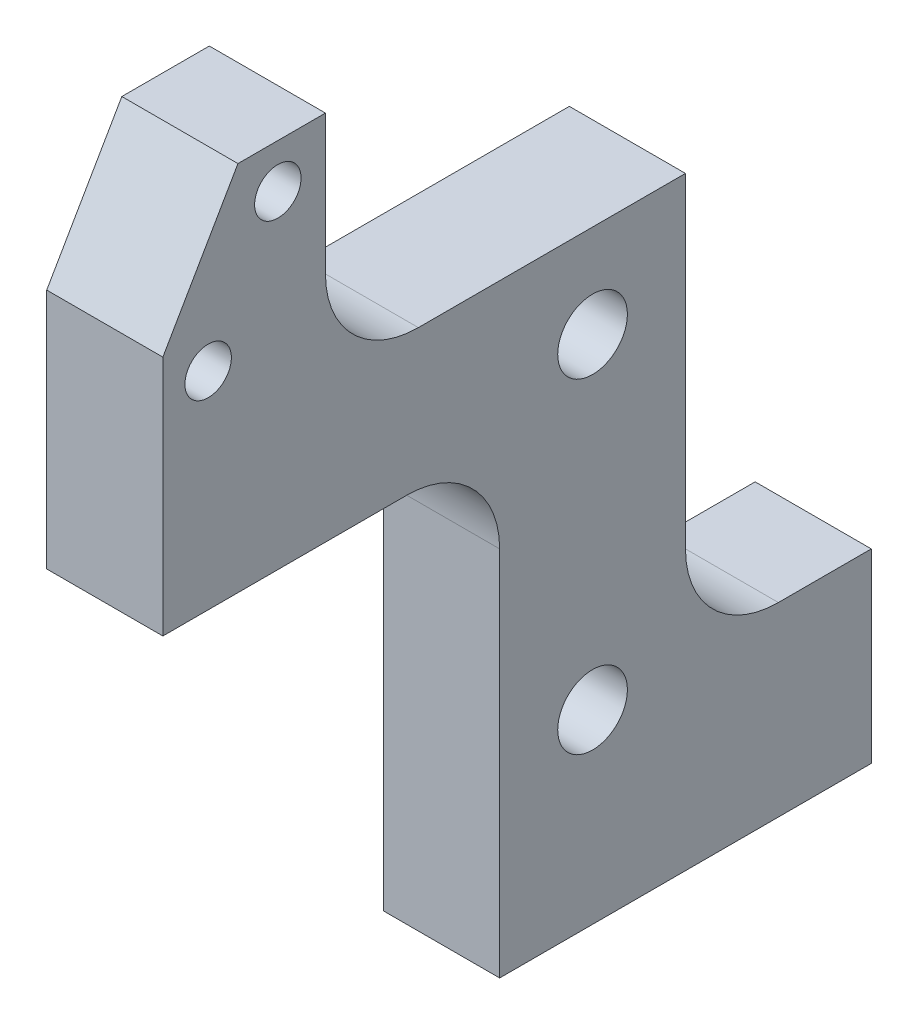
ISO-10303-21;
HEADER;
FILE_DESCRIPTION(('STEP AP214'),'2;1');
FILE_NAME('part.step','',(''),(''),'','','');
FILE_SCHEMA(('AUTOMOTIVE_DESIGN { 1 0 10303 214 1 1 1 1 }'));
ENDSEC;
DATA;
#1=APPLICATION_CONTEXT('core data for automotive mechanical design processes');
#2=APPLICATION_PROTOCOL_DEFINITION('international standard','automotive_design',2000,#1);
#3=PRODUCT_CONTEXT('',#1,'mechanical');
#4=PRODUCT('Part','Part','',(#3));
#5=PRODUCT_RELATED_PRODUCT_CATEGORY('part','',(#4));
#6=PRODUCT_DEFINITION_FORMATION('','',#4);
#7=PRODUCT_DEFINITION_CONTEXT('part definition',#1,'design');
#8=PRODUCT_DEFINITION('design','',#6,#7);
#9=PRODUCT_DEFINITION_SHAPE('','',#8);
#10=(LENGTH_UNIT() NAMED_UNIT(*) SI_UNIT(.MILLI.,.METRE.));
#11=(NAMED_UNIT(*) PLANE_ANGLE_UNIT() SI_UNIT($,.RADIAN.));
#12=(NAMED_UNIT(*) SI_UNIT($,.STERADIAN.) SOLID_ANGLE_UNIT());
#13=UNCERTAINTY_MEASURE_WITH_UNIT(LENGTH_MEASURE(1.E-05),#10,'distance_accuracy_value','');
#14=(GEOMETRIC_REPRESENTATION_CONTEXT(3) GLOBAL_UNCERTAINTY_ASSIGNED_CONTEXT((#13)) GLOBAL_UNIT_ASSIGNED_CONTEXT((#10,
#11,#12)) REPRESENTATION_CONTEXT('',''));
#15=CARTESIAN_POINT('',(0.,0.,0.));
#16=DIRECTION('',(0.,0.,1.));
#17=DIRECTION('',(1.,0.,0.));
#18=AXIS2_PLACEMENT_3D('',#15,#16,#17);
#19=CARTESIAN_POINT('',(5.,0.,0.));
#20=DIRECTION('',(-1.,0.,0.));
#21=DIRECTION('',(0.,0.,1.));
#22=AXIS2_PLACEMENT_3D('',#19,#20,#21);
#23=PLANE('',#22);
#24=CARTESIAN_POINT('',(5.,28.91,-1.95));
#25=DIRECTION('',(1.,0.,0.));
#26=DIRECTION('',(0.,0.,-1.));
#27=AXIS2_PLACEMENT_3D('',#24,#25,#26);
#28=CIRCLE('',#27,1.);
#29=CARTESIAN_POINT('',(5.,28.91,-2.95));
#30=VERTEX_POINT('',#29);
#31=EDGE_CURVE('E233',#30,#30,#28,.T.);
#32=ORIENTED_EDGE('',*,*,#31,.F.);
#33=EDGE_LOOP('',(#32));
#34=FACE_BOUND('',#33,.T.);
#35=CARTESIAN_POINT('',(5.,8.,-18.5));
#36=DIRECTION('',(1.,0.,0.));
#37=DIRECTION('',(0.,0.,-1.));
#38=AXIS2_PLACEMENT_3D('',#35,#36,#37);
#39=CIRCLE('',#38,1.5);
#40=CARTESIAN_POINT('',(5.,8.,-20.));
#41=VERTEX_POINT('',#40);
#42=EDGE_CURVE('E240',#41,#41,#39,.T.);
#43=ORIENTED_EDGE('',*,*,#42,.F.);
#44=EDGE_LOOP('',(#43));
#45=FACE_BOUND('',#44,.T.);
#46=DIRECTION('',(0.,1.,0.));
#47=VECTOR('',#46,1.);
#48=CARTESIAN_POINT('',(5.,8.,-30.5));
#49=LINE('',#48,#47);
#50=CARTESIAN_POINT('',(5.,0.,-30.5));
#51=VERTEX_POINT('',#50);
#52=CARTESIAN_POINT('',(5.,8.,-30.5));
#53=VERTEX_POINT('',#52);
#54=EDGE_CURVE('E147',#51,#53,#49,.T.);
#55=ORIENTED_EDGE('',*,*,#54,.T.);
#56=DIRECTION('',(0.,0.,1.));
#57=VECTOR('',#56,1.);
#58=CARTESIAN_POINT('',(5.,8.,-22.5));
#59=LINE('',#58,#57);
#60=CARTESIAN_POINT('',(5.,8.,-26.5));
#61=VERTEX_POINT('',#60);
#62=EDGE_CURVE('E135',#53,#61,#59,.T.);
#63=ORIENTED_EDGE('',*,*,#62,.T.);
#64=CARTESIAN_POINT('',(5.,12.,-26.5));
#65=DIRECTION('',(-1.,0.,0.));
#66=DIRECTION('',(0.,0.,1.));
#67=AXIS2_PLACEMENT_3D('',#64,#65,#66);
#68=CIRCLE('',#67,4.);
#69=CARTESIAN_POINT('',(5.,12.,-22.5));
#70=VERTEX_POINT('',#69);
#71=EDGE_CURVE('E183',#61,#70,#68,.T.);
#72=ORIENTED_EDGE('',*,*,#71,.T.);
#73=DIRECTION('',(0.,1.,0.));
#74=VECTOR('',#73,1.);
#75=CARTESIAN_POINT('',(5.,26.,-22.5));
#76=LINE('',#75,#74);
#77=CARTESIAN_POINT('',(5.,26.,-22.5));
#78=VERTEX_POINT('',#77);
#79=EDGE_CURVE('E146',#70,#78,#76,.T.);
#80=ORIENTED_EDGE('',*,*,#79,.T.);
#81=DIRECTION('',(0.,0.,1.));
#82=VECTOR('',#81,1.);
#83=CARTESIAN_POINT('',(5.,26.,-7.));
#84=LINE('',#83,#82);
#85=CARTESIAN_POINT('',(5.,26.,-11.));
#86=VERTEX_POINT('',#85);
#87=EDGE_CURVE('E244',#78,#86,#84,.T.);
#88=ORIENTED_EDGE('',*,*,#87,.T.);
#89=CARTESIAN_POINT('',(5.,30.,-11.));
#90=DIRECTION('',(-1.,0.,0.));
#91=DIRECTION('',(0.,0.,1.));
#92=AXIS2_PLACEMENT_3D('',#89,#90,#91);
#93=CIRCLE('',#92,4.);
#94=CARTESIAN_POINT('',(5.,30.,-7.));
#95=VERTEX_POINT('',#94);
#96=EDGE_CURVE('E190',#86,#95,#93,.T.);
#97=ORIENTED_EDGE('',*,*,#96,.T.);
#98=DIRECTION('',(0.,1.,0.));
#99=VECTOR('',#98,1.);
#100=CARTESIAN_POINT('',(5.,36.,-7.));
#101=LINE('',#100,#99);
#102=CARTESIAN_POINT('',(5.,36.,-7.));
#103=VERTEX_POINT('',#102);
#104=EDGE_CURVE('E246',#95,#103,#101,.T.);
#105=ORIENTED_EDGE('',*,*,#104,.T.);
#106=DIRECTION('',(0.,0.,1.));
#107=VECTOR('',#106,1.);
#108=CARTESIAN_POINT('',(5.,36.,-3.23316150746188));
#109=LINE('',#108,#107);
#110=CARTESIAN_POINT('',(5.,36.,-3.23316150746188));
#111=VERTEX_POINT('',#110);
#112=EDGE_CURVE('E248',#103,#111,#109,.T.);
#113=ORIENTED_EDGE('',*,*,#112,.T.);
#114=DIRECTION('',(0.,-0.86602540378444,0.499999999999998));
#115=VECTOR('',#114,1.);
#116=CARTESIAN_POINT('',(5.,30.4,0.));
#117=LINE('',#116,#115);
#118=CARTESIAN_POINT('',(5.,30.4,0.));
#119=VERTEX_POINT('',#118);
#120=EDGE_CURVE('E250',#111,#119,#117,.T.);
#121=ORIENTED_EDGE('',*,*,#120,.T.);
#122=DIRECTION('',(0.,-1.,0.));
#123=VECTOR('',#122,1.);
#124=CARTESIAN_POINT('',(5.,20.,0.));
#125=LINE('',#124,#123);
#126=CARTESIAN_POINT('',(5.,20.,0.));
#127=VERTEX_POINT('',#126);
#128=EDGE_CURVE('E252',#119,#127,#125,.T.);
#129=ORIENTED_EDGE('',*,*,#128,.T.);
#130=DIRECTION('',(0.,0.,-1.));
#131=VECTOR('',#130,1.);
#132=CARTESIAN_POINT('',(5.,20.,-14.5));
#133=LINE('',#132,#131);
#134=CARTESIAN_POINT('',(5.,20.,-10.5));
#135=VERTEX_POINT('',#134);
#136=EDGE_CURVE('E254',#127,#135,#133,.T.);
#137=ORIENTED_EDGE('',*,*,#136,.T.);
#138=CARTESIAN_POINT('',(5.,16.,-10.5));
#139=DIRECTION('',(-1.,0.,0.));
#140=DIRECTION('',(0.,0.,1.));
#141=AXIS2_PLACEMENT_3D('',#138,#139,#140);
#142=CIRCLE('',#141,4.);
#143=CARTESIAN_POINT('',(5.,16.,-14.5));
#144=VERTEX_POINT('',#143);
#145=EDGE_CURVE('E187',#135,#144,#142,.T.);
#146=ORIENTED_EDGE('',*,*,#145,.T.);
#147=DIRECTION('',(0.,-1.,0.));
#148=VECTOR('',#147,1.);
#149=CARTESIAN_POINT('',(5.,0.,-14.5));
#150=LINE('',#149,#148);
#151=CARTESIAN_POINT('',(5.,0.,-14.5));
#152=VERTEX_POINT('',#151);
#153=EDGE_CURVE('E257',#144,#152,#150,.T.);
#154=ORIENTED_EDGE('',*,*,#153,.T.);
#155=DIRECTION('',(0.,0.,-1.));
#156=VECTOR('',#155,1.);
#157=CARTESIAN_POINT('',(5.,0.,-30.5));
#158=LINE('',#157,#156);
#159=EDGE_CURVE('E152',#152,#51,#158,.T.);
#160=ORIENTED_EDGE('',*,*,#159,.T.);
#161=EDGE_LOOP('',(#55,#63,#72,#80,#88,#97,#105,#113,#121,#129,#137,#146,#154,#160));
#162=FACE_BOUND('',#161,.T.);
#163=CARTESIAN_POINT('',(5.,22.,-18.5));
#164=DIRECTION('',(1.,0.,0.));
#165=DIRECTION('',(0.,0.,-1.));
#166=AXIS2_PLACEMENT_3D('',#163,#164,#165);
#167=CIRCLE('',#166,1.5);
#168=CARTESIAN_POINT('',(5.,22.,-20.));
#169=VERTEX_POINT('',#168);
#170=EDGE_CURVE('E236',#169,#169,#167,.T.);
#171=ORIENTED_EDGE('',*,*,#170,.F.);
#172=EDGE_LOOP('',(#171));
#173=FACE_BOUND('',#172,.T.);
#174=CARTESIAN_POINT('',(5.,34.1061524227066,-4.94999999999999));
#175=DIRECTION('',(1.,0.,0.));
#176=DIRECTION('',(0.,0.,-1.));
#177=AXIS2_PLACEMENT_3D('',#174,#175,#176);
#178=CIRCLE('',#177,0.999999999999998);
#179=CARTESIAN_POINT('',(5.,34.1061524227066,-5.94999999999999));
#180=VERTEX_POINT('',#179);
#181=EDGE_CURVE('E224',#180,#180,#178,.T.);
#182=ORIENTED_EDGE('',*,*,#181,.F.);
#183=EDGE_LOOP('',(#182));
#184=FACE_BOUND('',#183,.T.);
#185=ADVANCED_FACE('F32',(#34,#45,#162,#173,#184),#23,.F.);
#186=CARTESIAN_POINT('',(0.,0.,0.));
#187=DIRECTION('',(-1.,0.,0.));
#188=DIRECTION('',(0.,0.,1.));
#189=AXIS2_PLACEMENT_3D('',#186,#187,#188);
#190=PLANE('',#189);
#191=CARTESIAN_POINT('',(0.,8.,-18.5));
#192=DIRECTION('',(-1.,0.,0.));
#193=DIRECTION('',(0.,0.,1.));
#194=AXIS2_PLACEMENT_3D('',#191,#192,#193);
#195=CIRCLE('',#194,3.);
#196=CARTESIAN_POINT('',(0.,8.,-15.5));
#197=VERTEX_POINT('',#196);
#198=EDGE_CURVE('E195',#197,#197,#195,.F.);
#199=ORIENTED_EDGE('',*,*,#198,.T.);
#200=EDGE_LOOP('',(#199));
#201=FACE_BOUND('',#200,.T.);
#202=CARTESIAN_POINT('',(0.,22.,-18.5));
#203=DIRECTION('',(-1.,0.,0.));
#204=DIRECTION('',(0.,0.,1.));
#205=AXIS2_PLACEMENT_3D('',#202,#203,#204);
#206=CIRCLE('',#205,3.);
#207=CARTESIAN_POINT('',(0.,22.,-15.5));
#208=VERTEX_POINT('',#207);
#209=EDGE_CURVE('E192',#208,#208,#206,.F.);
#210=ORIENTED_EDGE('',*,*,#209,.T.);
#211=EDGE_LOOP('',(#210));
#212=FACE_BOUND('',#211,.T.);
#213=CARTESIAN_POINT('',(0.,28.91,-1.95));
#214=DIRECTION('',(1.,0.,0.));
#215=DIRECTION('',(0.,0.,-1.));
#216=AXIS2_PLACEMENT_3D('',#213,#214,#215);
#217=CIRCLE('',#216,1.);
#218=CARTESIAN_POINT('',(0.,28.91,-2.95));
#219=VERTEX_POINT('',#218);
#220=EDGE_CURVE('E217',#219,#219,#217,.T.);
#221=ORIENTED_EDGE('',*,*,#220,.T.);
#222=EDGE_LOOP('',(#221));
#223=FACE_BOUND('',#222,.T.);
#224=DIRECTION('',(0.,1.,0.));
#225=VECTOR('',#224,1.);
#226=CARTESIAN_POINT('',(0.,8.,-30.5));
#227=LINE('',#226,#225);
#228=CARTESIAN_POINT('',(0.,0.,-30.5));
#229=VERTEX_POINT('',#228);
#230=CARTESIAN_POINT('',(0.,8.,-30.5));
#231=VERTEX_POINT('',#230);
#232=EDGE_CURVE('E160',#229,#231,#227,.T.);
#233=ORIENTED_EDGE('',*,*,#232,.F.);
#234=DIRECTION('',(0.,0.,-1.));
#235=VECTOR('',#234,1.);
#236=CARTESIAN_POINT('',(0.,0.,-30.5));
#237=LINE('',#236,#235);
#238=CARTESIAN_POINT('',(0.,0.,-14.5));
#239=VERTEX_POINT('',#238);
#240=EDGE_CURVE('E156',#239,#229,#237,.T.);
#241=ORIENTED_EDGE('',*,*,#240,.F.);
#242=DIRECTION('',(0.,-1.,0.));
#243=VECTOR('',#242,1.);
#244=CARTESIAN_POINT('',(0.,0.,-14.5));
#245=LINE('',#244,#243);
#246=CARTESIAN_POINT('',(0.,16.,-14.5));
#247=VERTEX_POINT('',#246);
#248=EDGE_CURVE('E279',#247,#239,#245,.T.);
#249=ORIENTED_EDGE('',*,*,#248,.F.);
#250=CARTESIAN_POINT('',(0.,16.,-10.5));
#251=DIRECTION('',(-1.,0.,0.));
#252=DIRECTION('',(0.,0.,1.));
#253=AXIS2_PLACEMENT_3D('',#250,#251,#252);
#254=CIRCLE('',#253,4.);
#255=CARTESIAN_POINT('',(0.,20.,-10.5));
#256=VERTEX_POINT('',#255);
#257=EDGE_CURVE('E185',#247,#256,#254,.F.);
#258=ORIENTED_EDGE('',*,*,#257,.T.);
#259=DIRECTION('',(0.,0.,-1.));
#260=VECTOR('',#259,1.);
#261=CARTESIAN_POINT('',(0.,20.,-14.5));
#262=LINE('',#261,#260);
#263=CARTESIAN_POINT('',(0.,20.,0.));
#264=VERTEX_POINT('',#263);
#265=EDGE_CURVE('E276',#264,#256,#262,.T.);
#266=ORIENTED_EDGE('',*,*,#265,.F.);
#267=DIRECTION('',(0.,-1.,0.));
#268=VECTOR('',#267,1.);
#269=CARTESIAN_POINT('',(0.,20.,0.));
#270=LINE('',#269,#268);
#271=CARTESIAN_POINT('',(0.,30.4,0.));
#272=VERTEX_POINT('',#271);
#273=EDGE_CURVE('E274',#272,#264,#270,.T.);
#274=ORIENTED_EDGE('',*,*,#273,.F.);
#275=DIRECTION('',(0.,-0.86602540378444,0.499999999999998));
#276=VECTOR('',#275,1.);
#277=CARTESIAN_POINT('',(0.,30.4,0.));
#278=LINE('',#277,#276);
#279=CARTESIAN_POINT('',(0.,36.,-3.23316150746188));
#280=VERTEX_POINT('',#279);
#281=EDGE_CURVE('E272',#280,#272,#278,.T.);
#282=ORIENTED_EDGE('',*,*,#281,.F.);
#283=DIRECTION('',(0.,0.,1.));
#284=VECTOR('',#283,1.);
#285=CARTESIAN_POINT('',(0.,36.,-3.23316150746188));
#286=LINE('',#285,#284);
#287=CARTESIAN_POINT('',(0.,36.,-7.));
#288=VERTEX_POINT('',#287);
#289=EDGE_CURVE('E270',#288,#280,#286,.T.);
#290=ORIENTED_EDGE('',*,*,#289,.F.);
#291=DIRECTION('',(0.,1.,0.));
#292=VECTOR('',#291,1.);
#293=CARTESIAN_POINT('',(0.,36.,-7.));
#294=LINE('',#293,#292);
#295=CARTESIAN_POINT('',(0.,30.,-7.));
#296=VERTEX_POINT('',#295);
#297=EDGE_CURVE('E268',#296,#288,#294,.T.);
#298=ORIENTED_EDGE('',*,*,#297,.F.);
#299=CARTESIAN_POINT('',(0.,30.,-11.));
#300=DIRECTION('',(-1.,0.,0.));
#301=DIRECTION('',(0.,0.,1.));
#302=AXIS2_PLACEMENT_3D('',#299,#300,#301);
#303=CIRCLE('',#302,4.);
#304=CARTESIAN_POINT('',(0.,26.,-11.));
#305=VERTEX_POINT('',#304);
#306=EDGE_CURVE('E55',#296,#305,#303,.F.);
#307=ORIENTED_EDGE('',*,*,#306,.T.);
#308=DIRECTION('',(0.,0.,1.));
#309=VECTOR('',#308,1.);
#310=CARTESIAN_POINT('',(0.,26.,-7.));
#311=LINE('',#310,#309);
#312=CARTESIAN_POINT('',(0.,26.,-22.5));
#313=VERTEX_POINT('',#312);
#314=EDGE_CURVE('E266',#313,#305,#311,.T.);
#315=ORIENTED_EDGE('',*,*,#314,.F.);
#316=DIRECTION('',(0.,1.,0.));
#317=VECTOR('',#316,1.);
#318=CARTESIAN_POINT('',(0.,26.,-22.5));
#319=LINE('',#318,#317);
#320=CARTESIAN_POINT('',(0.,12.,-22.5));
#321=VERTEX_POINT('',#320);
#322=EDGE_CURVE('E264',#321,#313,#319,.T.);
#323=ORIENTED_EDGE('',*,*,#322,.F.);
#324=CARTESIAN_POINT('',(0.,12.,-26.5));
#325=DIRECTION('',(-1.,0.,0.));
#326=DIRECTION('',(0.,0.,1.));
#327=AXIS2_PLACEMENT_3D('',#324,#325,#326);
#328=CIRCLE('',#327,4.);
#329=CARTESIAN_POINT('',(0.,8.,-26.5));
#330=VERTEX_POINT('',#329);
#331=EDGE_CURVE('E181',#321,#330,#328,.F.);
#332=ORIENTED_EDGE('',*,*,#331,.T.);
#333=DIRECTION('',(0.,0.,1.));
#334=VECTOR('',#333,1.);
#335=CARTESIAN_POINT('',(0.,8.,-22.5));
#336=LINE('',#335,#334);
#337=EDGE_CURVE('E262',#231,#330,#336,.T.);
#338=ORIENTED_EDGE('',*,*,#337,.F.);
#339=EDGE_LOOP('',(#233,#241,#249,#258,#266,#274,#282,#290,#298,#307,#315,#323,#332,#338));
#340=FACE_BOUND('',#339,.T.);
#341=CARTESIAN_POINT('',(0.,34.1061524227066,-4.94999999999999));
#342=DIRECTION('',(1.,0.,0.));
#343=DIRECTION('',(0.,0.,-1.));
#344=AXIS2_PLACEMENT_3D('',#341,#342,#343);
#345=CIRCLE('',#344,0.999999999999998);
#346=CARTESIAN_POINT('',(0.,34.1061524227066,-5.94999999999999));
#347=VERTEX_POINT('',#346);
#348=EDGE_CURVE('E222',#347,#347,#345,.T.);
#349=ORIENTED_EDGE('',*,*,#348,.T.);
#350=EDGE_LOOP('',(#349));
#351=FACE_BOUND('',#350,.T.);
#352=ADVANCED_FACE('F209',(#201,#212,#223,#340,#351),#190,.T.);
#353=CARTESIAN_POINT('',(5.,8.,-30.5));
#354=DIRECTION('',(0.,0.,1.));
#355=DIRECTION('',(1.,0.,0.));
#356=AXIS2_PLACEMENT_3D('',#353,#354,#355);
#357=PLANE('',#356);
#358=ORIENTED_EDGE('',*,*,#232,.T.);
#359=DIRECTION('',(-1.,0.,0.));
#360=VECTOR('',#359,1.);
#361=CARTESIAN_POINT('',(5.,8.,-30.5));
#362=LINE('',#361,#360);
#363=EDGE_CURVE('E140',#53,#231,#362,.T.);
#364=ORIENTED_EDGE('',*,*,#363,.F.);
#365=ORIENTED_EDGE('',*,*,#54,.F.);
#366=DIRECTION('',(-1.,0.,0.));
#367=VECTOR('',#366,1.);
#368=CARTESIAN_POINT('',(5.,0.,-30.5));
#369=LINE('',#368,#367);
#370=EDGE_CURVE('E260',#51,#229,#369,.T.);
#371=ORIENTED_EDGE('',*,*,#370,.T.);
#372=EDGE_LOOP('',(#358,#364,#365,#371));
#373=FACE_BOUND('',#372,.T.);
#374=ADVANCED_FACE('F158',(#373),#357,.F.);
#375=CARTESIAN_POINT('',(5.,8.,-22.5));
#376=DIRECTION('',(0.,-1.,0.));
#377=DIRECTION('',(0.,0.,-1.));
#378=AXIS2_PLACEMENT_3D('',#375,#376,#377);
#379=PLANE('',#378);
#380=ORIENTED_EDGE('',*,*,#337,.T.);
#381=DIRECTION('',(-1.,0.,0.));
#382=VECTOR('',#381,1.);
#383=CARTESIAN_POINT('',(5.,8.,-26.5));
#384=LINE('',#383,#382);
#385=EDGE_CURVE('E143',#330,#61,#384,.F.);
#386=ORIENTED_EDGE('',*,*,#385,.T.);
#387=ORIENTED_EDGE('',*,*,#62,.F.);
#388=ORIENTED_EDGE('',*,*,#363,.T.);
#389=EDGE_LOOP('',(#380,#386,#387,#388));
#390=FACE_BOUND('',#389,.T.);
#391=ADVANCED_FACE('F138',(#390),#379,.F.);
#392=CARTESIAN_POINT('',(5.,26.,-22.5));
#393=DIRECTION('',(0.,0.,1.));
#394=DIRECTION('',(0.,-1.,0.));
#395=AXIS2_PLACEMENT_3D('',#392,#393,#394);
#396=PLANE('',#395);
#397=ORIENTED_EDGE('',*,*,#79,.F.);
#398=DIRECTION('',(-1.,0.,0.));
#399=VECTOR('',#398,1.);
#400=CARTESIAN_POINT('',(0.,12.,-22.5));
#401=LINE('',#400,#399);
#402=EDGE_CURVE('E161',#70,#321,#401,.T.);
#403=ORIENTED_EDGE('',*,*,#402,.T.);
#404=ORIENTED_EDGE('',*,*,#322,.T.);
#405=DIRECTION('',(-1.,0.,0.));
#406=VECTOR('',#405,1.);
#407=CARTESIAN_POINT('',(5.,26.,-22.5));
#408=LINE('',#407,#406);
#409=EDGE_CURVE('E162',#78,#313,#408,.T.);
#410=ORIENTED_EDGE('',*,*,#409,.F.);
#411=EDGE_LOOP('',(#397,#403,#404,#410));
#412=FACE_BOUND('',#411,.T.);
#413=ADVANCED_FACE('F368',(#412),#396,.F.);
#414=CARTESIAN_POINT('',(5.,26.,-7.));
#415=DIRECTION('',(0.,-1.,0.));
#416=DIRECTION('',(0.,0.,-1.));
#417=AXIS2_PLACEMENT_3D('',#414,#415,#416);
#418=PLANE('',#417);
#419=ORIENTED_EDGE('',*,*,#314,.T.);
#420=DIRECTION('',(-1.,0.,0.));
#421=VECTOR('',#420,1.);
#422=CARTESIAN_POINT('',(5.,26.,-11.));
#423=LINE('',#422,#421);
#424=EDGE_CURVE('E47',#305,#86,#423,.F.);
#425=ORIENTED_EDGE('',*,*,#424,.T.);
#426=ORIENTED_EDGE('',*,*,#87,.F.);
#427=ORIENTED_EDGE('',*,*,#409,.T.);
#428=EDGE_LOOP('',(#419,#425,#426,#427));
#429=FACE_BOUND('',#428,.T.);
#430=ADVANCED_FACE('F365',(#429),#418,.F.);
#431=CARTESIAN_POINT('',(5.,36.,-7.));
#432=DIRECTION('',(0.,0.,1.));
#433=DIRECTION('',(0.,-1.,0.));
#434=AXIS2_PLACEMENT_3D('',#431,#432,#433);
#435=PLANE('',#434);
#436=ORIENTED_EDGE('',*,*,#104,.F.);
#437=DIRECTION('',(-1.,0.,0.));
#438=VECTOR('',#437,1.);
#439=CARTESIAN_POINT('',(0.,30.,-7.));
#440=LINE('',#439,#438);
#441=EDGE_CURVE('E177',#95,#296,#440,.T.);
#442=ORIENTED_EDGE('',*,*,#441,.T.);
#443=ORIENTED_EDGE('',*,*,#297,.T.);
#444=DIRECTION('',(-1.,0.,0.));
#445=VECTOR('',#444,1.);
#446=CARTESIAN_POINT('',(5.,36.,-7.));
#447=LINE('',#446,#445);
#448=EDGE_CURVE('E167',#103,#288,#447,.T.);
#449=ORIENTED_EDGE('',*,*,#448,.F.);
#450=EDGE_LOOP('',(#436,#442,#443,#449));
#451=FACE_BOUND('',#450,.T.);
#452=ADVANCED_FACE('F318',(#451),#435,.F.);
#453=CARTESIAN_POINT('',(5.,36.,-3.23316150746188));
#454=DIRECTION('',(0.,-1.,0.));
#455=DIRECTION('',(0.,0.,-1.));
#456=AXIS2_PLACEMENT_3D('',#453,#454,#455);
#457=PLANE('',#456);
#458=ORIENTED_EDGE('',*,*,#289,.T.);
#459=DIRECTION('',(-1.,0.,0.));
#460=VECTOR('',#459,1.);
#461=CARTESIAN_POINT('',(5.,36.,-3.23316150746188));
#462=LINE('',#461,#460);
#463=EDGE_CURVE('E292',#111,#280,#462,.T.);
#464=ORIENTED_EDGE('',*,*,#463,.F.);
#465=ORIENTED_EDGE('',*,*,#112,.F.);
#466=ORIENTED_EDGE('',*,*,#448,.T.);
#467=EDGE_LOOP('',(#458,#464,#465,#466));
#468=FACE_BOUND('',#467,.T.);
#469=ADVANCED_FACE('F299',(#468),#457,.F.);
#470=CARTESIAN_POINT('',(5.,30.4,0.));
#471=DIRECTION('',(0.,-0.499999999999998,-0.86602540378444));
#472=DIRECTION('',(0.,0.86602540378444,-0.499999999999998));
#473=AXIS2_PLACEMENT_3D('',#470,#471,#472);
#474=PLANE('',#473);
#475=ORIENTED_EDGE('',*,*,#281,.T.);
#476=DIRECTION('',(-1.,0.,0.));
#477=VECTOR('',#476,1.);
#478=CARTESIAN_POINT('',(5.,30.4,0.));
#479=LINE('',#478,#477);
#480=EDGE_CURVE('E289',#119,#272,#479,.T.);
#481=ORIENTED_EDGE('',*,*,#480,.F.);
#482=ORIENTED_EDGE('',*,*,#120,.F.);
#483=ORIENTED_EDGE('',*,*,#463,.T.);
#484=EDGE_LOOP('',(#475,#481,#482,#483));
#485=FACE_BOUND('',#484,.T.);
#486=ADVANCED_FACE('F308',(#485),#474,.F.);
#487=CARTESIAN_POINT('',(5.,20.,0.));
#488=DIRECTION('',(0.,0.,-1.));
#489=DIRECTION('',(0.,1.,0.));
#490=AXIS2_PLACEMENT_3D('',#487,#488,#489);
#491=PLANE('',#490);
#492=ORIENTED_EDGE('',*,*,#273,.T.);
#493=DIRECTION('',(-1.,0.,0.));
#494=VECTOR('',#493,1.);
#495=CARTESIAN_POINT('',(5.,20.,0.));
#496=LINE('',#495,#494);
#497=EDGE_CURVE('E286',#127,#264,#496,.T.);
#498=ORIENTED_EDGE('',*,*,#497,.F.);
#499=ORIENTED_EDGE('',*,*,#128,.F.);
#500=ORIENTED_EDGE('',*,*,#480,.T.);
#501=EDGE_LOOP('',(#492,#498,#499,#500));
#502=FACE_BOUND('',#501,.T.);
#503=ADVANCED_FACE('F312',(#502),#491,.F.);
#504=CARTESIAN_POINT('',(5.,20.,-14.5));
#505=DIRECTION('',(0.,1.,0.));
#506=DIRECTION('',(0.,0.,1.));
#507=AXIS2_PLACEMENT_3D('',#504,#505,#506);
#508=PLANE('',#507);
#509=ORIENTED_EDGE('',*,*,#265,.T.);
#510=DIRECTION('',(-1.,0.,0.));
#511=VECTOR('',#510,1.);
#512=CARTESIAN_POINT('',(5.,20.,-10.5));
#513=LINE('',#512,#511);
#514=EDGE_CURVE('E175',#256,#135,#513,.F.);
#515=ORIENTED_EDGE('',*,*,#514,.T.);
#516=ORIENTED_EDGE('',*,*,#136,.F.);
#517=ORIENTED_EDGE('',*,*,#497,.T.);
#518=EDGE_LOOP('',(#509,#515,#516,#517));
#519=FACE_BOUND('',#518,.T.);
#520=ADVANCED_FACE('F352',(#519),#508,.F.);
#521=CARTESIAN_POINT('',(5.,0.,-14.5));
#522=DIRECTION('',(0.,0.,-1.));
#523=DIRECTION('',(-1.,0.,0.));
#524=AXIS2_PLACEMENT_3D('',#521,#522,#523);
#525=PLANE('',#524);
#526=ORIENTED_EDGE('',*,*,#153,.F.);
#527=DIRECTION('',(-1.,0.,0.));
#528=VECTOR('',#527,1.);
#529=CARTESIAN_POINT('',(0.,16.,-14.5));
#530=LINE('',#529,#528);
#531=EDGE_CURVE('E172',#144,#247,#530,.T.);
#532=ORIENTED_EDGE('',*,*,#531,.T.);
#533=ORIENTED_EDGE('',*,*,#248,.T.);
#534=DIRECTION('',(-1.,0.,0.));
#535=VECTOR('',#534,1.);
#536=CARTESIAN_POINT('',(5.,0.,-14.5));
#537=LINE('',#536,#535);
#538=EDGE_CURVE('E283',#152,#239,#537,.T.);
#539=ORIENTED_EDGE('',*,*,#538,.F.);
#540=EDGE_LOOP('',(#526,#532,#533,#539));
#541=FACE_BOUND('',#540,.T.);
#542=ADVANCED_FACE('F348',(#541),#525,.F.);
#543=CARTESIAN_POINT('',(5.,0.,-30.5));
#544=DIRECTION('',(0.,1.,0.));
#545=DIRECTION('',(0.,0.,1.));
#546=AXIS2_PLACEMENT_3D('',#543,#544,#545);
#547=PLANE('',#546);
#548=CARTESIAN_POINT('',(2.5,0.,-17.5));
#549=DIRECTION('',(0.,-1.,0.));
#550=DIRECTION('',(0.,0.,-1.));
#551=AXIS2_PLACEMENT_3D('',#548,#549,#550);
#552=CIRCLE('',#551,1.25);
#553=CARTESIAN_POINT('',(2.5,0.,-18.75));
#554=VERTEX_POINT('',#553);
#555=EDGE_CURVE('E572',#554,#554,#552,.T.);
#556=ORIENTED_EDGE('',*,*,#555,.F.);
#557=EDGE_LOOP('',(#556));
#558=FACE_BOUND('',#557,.T.);
#559=CARTESIAN_POINT('',(2.5,0.,-27.5));
#560=DIRECTION('',(0.,-1.,0.));
#561=DIRECTION('',(0.,0.,-1.));
#562=AXIS2_PLACEMENT_3D('',#559,#560,#561);
#563=CIRCLE('',#562,1.25);
#564=CARTESIAN_POINT('',(2.5,0.,-28.75));
#565=VERTEX_POINT('',#564);
#566=EDGE_CURVE('E230',#565,#565,#563,.T.);
#567=ORIENTED_EDGE('',*,*,#566,.F.);
#568=EDGE_LOOP('',(#567));
#569=FACE_BOUND('',#568,.T.);
#570=ORIENTED_EDGE('',*,*,#240,.T.);
#571=ORIENTED_EDGE('',*,*,#370,.F.);
#572=ORIENTED_EDGE('',*,*,#159,.F.);
#573=ORIENTED_EDGE('',*,*,#538,.T.);
#574=EDGE_LOOP('',(#570,#571,#572,#573));
#575=FACE_BOUND('',#574,.T.);
#576=ADVANCED_FACE('F345',(#558,#569,#575),#547,.F.);
#577=CARTESIAN_POINT('',(5.,8.,-18.5));
#578=DIRECTION('',(-1.,0.,0.));
#579=DIRECTION('',(0.,0.,1.));
#580=AXIS2_PLACEMENT_3D('',#577,#578,#579);
#581=CYLINDRICAL_SURFACE('',#580,1.5);
#582=CARTESIAN_POINT('',(1.50000000000001,8.,-18.5));
#583=DIRECTION('',(-1.,0.,0.));
#584=DIRECTION('',(0.,0.,1.));
#585=AXIS2_PLACEMENT_3D('',#582,#583,#584);
#586=CIRCLE('',#585,1.5);
#587=CARTESIAN_POINT('',(1.50000000000001,8.,-17.));
#588=VERTEX_POINT('',#587);
#589=EDGE_CURVE('E40',#588,#588,#586,.T.);
#590=ORIENTED_EDGE('',*,*,#589,.T.);
#591=EDGE_LOOP('',(#590));
#592=FACE_BOUND('',#591,.T.);
#593=ORIENTED_EDGE('',*,*,#42,.T.);
#594=EDGE_LOOP('',(#593));
#595=FACE_BOUND('',#594,.T.);
#596=ADVANCED_FACE('F200',(#592,#595),#581,.F.);
#597=CARTESIAN_POINT('',(5.,22.,-18.5));
#598=DIRECTION('',(-1.,0.,0.));
#599=DIRECTION('',(0.,0.,1.));
#600=AXIS2_PLACEMENT_3D('',#597,#598,#599);
#601=CYLINDRICAL_SURFACE('',#600,1.5);
#602=CARTESIAN_POINT('',(1.50000000000001,22.,-18.5));
#603=DIRECTION('',(-1.,0.,0.));
#604=DIRECTION('',(0.,0.,1.));
#605=AXIS2_PLACEMENT_3D('',#602,#603,#604);
#606=CIRCLE('',#605,1.5);
#607=CARTESIAN_POINT('',(1.50000000000001,22.,-17.));
#608=VERTEX_POINT('',#607);
#609=EDGE_CURVE('E11',#608,#608,#606,.T.);
#610=ORIENTED_EDGE('',*,*,#609,.T.);
#611=EDGE_LOOP('',(#610));
#612=FACE_BOUND('',#611,.T.);
#613=ORIENTED_EDGE('',*,*,#170,.T.);
#614=EDGE_LOOP('',(#613));
#615=FACE_BOUND('',#614,.T.);
#616=ADVANCED_FACE('F392',(#612,#615),#601,.F.);
#617=CARTESIAN_POINT('',(5.,28.91,-1.95));
#618=DIRECTION('',(-1.,0.,0.));
#619=DIRECTION('',(0.,0.,1.));
#620=AXIS2_PLACEMENT_3D('',#617,#618,#619);
#621=CYLINDRICAL_SURFACE('',#620,1.);
#622=ORIENTED_EDGE('',*,*,#31,.T.);
#623=EDGE_LOOP('',(#622));
#624=FACE_BOUND('',#623,.T.);
#625=ORIENTED_EDGE('',*,*,#220,.F.);
#626=EDGE_LOOP('',(#625));
#627=FACE_BOUND('',#626,.T.);
#628=ADVANCED_FACE('F382',(#624,#627),#621,.F.);
#629=CARTESIAN_POINT('',(5.,34.1061524227066,-4.94999999999999));
#630=DIRECTION('',(-1.,0.,0.));
#631=DIRECTION('',(0.,0.,1.));
#632=AXIS2_PLACEMENT_3D('',#629,#630,#631);
#633=CYLINDRICAL_SURFACE('',#632,0.999999999999998);
#634=ORIENTED_EDGE('',*,*,#181,.T.);
#635=EDGE_LOOP('',(#634));
#636=FACE_BOUND('',#635,.T.);
#637=ORIENTED_EDGE('',*,*,#348,.F.);
#638=EDGE_LOOP('',(#637));
#639=FACE_BOUND('',#638,.T.);
#640=ADVANCED_FACE('F377',(#636,#639),#633,.F.);
#641=CARTESIAN_POINT('',(5.,12.,-26.5));
#642=DIRECTION('',(1.,0.,0.));
#643=DIRECTION('',(0.,0.,-1.));
#644=AXIS2_PLACEMENT_3D('',#641,#642,#643);
#645=CYLINDRICAL_SURFACE('',#644,4.);
#646=ORIENTED_EDGE('',*,*,#71,.F.);
#647=ORIENTED_EDGE('',*,*,#385,.F.);
#648=ORIENTED_EDGE('',*,*,#331,.F.);
#649=ORIENTED_EDGE('',*,*,#402,.F.);
#650=EDGE_LOOP('',(#646,#647,#648,#649));
#651=FACE_BOUND('',#650,.T.);
#652=ADVANCED_FACE('F332',(#651),#645,.F.);
#653=CARTESIAN_POINT('',(5.,16.,-10.5));
#654=DIRECTION('',(1.,0.,0.));
#655=DIRECTION('',(0.,0.,-1.));
#656=AXIS2_PLACEMENT_3D('',#653,#654,#655);
#657=CYLINDRICAL_SURFACE('',#656,4.);
#658=ORIENTED_EDGE('',*,*,#145,.F.);
#659=ORIENTED_EDGE('',*,*,#514,.F.);
#660=ORIENTED_EDGE('',*,*,#257,.F.);
#661=ORIENTED_EDGE('',*,*,#531,.F.);
#662=EDGE_LOOP('',(#658,#659,#660,#661));
#663=FACE_BOUND('',#662,.T.);
#664=ADVANCED_FACE('F323',(#663),#657,.F.);
#665=CARTESIAN_POINT('',(5.,30.,-11.));
#666=DIRECTION('',(1.,0.,0.));
#667=DIRECTION('',(0.,0.,-1.));
#668=AXIS2_PLACEMENT_3D('',#665,#666,#667);
#669=CYLINDRICAL_SURFACE('',#668,4.);
#670=ORIENTED_EDGE('',*,*,#96,.F.);
#671=ORIENTED_EDGE('',*,*,#424,.F.);
#672=ORIENTED_EDGE('',*,*,#306,.F.);
#673=ORIENTED_EDGE('',*,*,#441,.F.);
#674=EDGE_LOOP('',(#670,#671,#672,#673));
#675=FACE_BOUND('',#674,.T.);
#676=ADVANCED_FACE('F320',(#675),#669,.F.);
#677=CARTESIAN_POINT('',(2.5,4.,-27.5));
#678=DIRECTION('',(0.,1.,0.));
#679=DIRECTION('',(0.,0.,1.));
#680=AXIS2_PLACEMENT_3D('',#677,#678,#679);
#681=PLANE('',#680);
#682=CARTESIAN_POINT('',(2.5,4.,-27.5));
#683=DIRECTION('',(0.,-1.,0.));
#684=DIRECTION('',(0.,0.,-1.));
#685=AXIS2_PLACEMENT_3D('',#682,#683,#684);
#686=CIRCLE('',#685,1.25);
#687=CARTESIAN_POINT('',(2.5,4.,-28.75));
#688=VERTEX_POINT('',#687);
#689=EDGE_CURVE('E225',#688,#688,#686,.T.);
#690=ORIENTED_EDGE('',*,*,#689,.T.);
#691=EDGE_LOOP('',(#690));
#692=FACE_BOUND('',#691,.T.);
#693=ADVANCED_FACE('F322',(#692),#681,.F.);
#694=CARTESIAN_POINT('',(2.5,0.,-27.5));
#695=DIRECTION('',(0.,-1.,0.));
#696=DIRECTION('',(0.,0.,-1.));
#697=AXIS2_PLACEMENT_3D('',#694,#695,#696);
#698=CYLINDRICAL_SURFACE('',#697,1.25);
#699=ORIENTED_EDGE('',*,*,#689,.F.);
#700=EDGE_LOOP('',(#699));
#701=FACE_BOUND('',#700,.T.);
#702=ORIENTED_EDGE('',*,*,#566,.T.);
#703=EDGE_LOOP('',(#702));
#704=FACE_BOUND('',#703,.T.);
#705=ADVANCED_FACE('F329',(#701,#704),#698,.F.);
#706=CARTESIAN_POINT('',(2.5,4.,-17.5));
#707=DIRECTION('',(0.,1.,0.));
#708=DIRECTION('',(0.,0.,1.));
#709=AXIS2_PLACEMENT_3D('',#706,#707,#708);
#710=PLANE('',#709);
#711=CARTESIAN_POINT('',(2.5,4.,-17.5));
#712=DIRECTION('',(0.,-1.,0.));
#713=DIRECTION('',(0.,0.,-1.));
#714=AXIS2_PLACEMENT_3D('',#711,#712,#713);
#715=CIRCLE('',#714,1.25);
#716=CARTESIAN_POINT('',(2.5,4.,-18.75));
#717=VERTEX_POINT('',#716);
#718=EDGE_CURVE('E569',#717,#717,#715,.T.);
#719=ORIENTED_EDGE('',*,*,#718,.T.);
#720=EDGE_LOOP('',(#719));
#721=FACE_BOUND('',#720,.T.);
#722=ADVANCED_FACE('F421',(#721),#710,.F.);
#723=CARTESIAN_POINT('',(2.5,0.,-17.5));
#724=DIRECTION('',(0.,-1.,0.));
#725=DIRECTION('',(0.,0.,-1.));
#726=AXIS2_PLACEMENT_3D('',#723,#724,#725);
#727=CYLINDRICAL_SURFACE('',#726,1.25);
#728=ORIENTED_EDGE('',*,*,#718,.F.);
#729=EDGE_LOOP('',(#728));
#730=FACE_BOUND('',#729,.T.);
#731=ORIENTED_EDGE('',*,*,#555,.T.);
#732=EDGE_LOOP('',(#731));
#733=FACE_BOUND('',#732,.T.);
#734=ADVANCED_FACE('F206',(#730,#733),#727,.F.);
#735=CARTESIAN_POINT('',(0.,8.,-18.5));
#736=DIRECTION('',(-1.,0.,0.));
#737=DIRECTION('',(0.,0.,1.));
#738=AXIS2_PLACEMENT_3D('',#735,#736,#737);
#739=CONICAL_SURFACE('',#738,3.,0.785398163397444);
#740=ORIENTED_EDGE('',*,*,#589,.F.);
#741=EDGE_LOOP('',(#740));
#742=FACE_BOUND('',#741,.T.);
#743=ORIENTED_EDGE('',*,*,#198,.F.);
#744=EDGE_LOOP('',(#743));
#745=FACE_BOUND('',#744,.T.);
#746=ADVANCED_FACE('F203',(#742,#745),#739,.F.);
#747=CARTESIAN_POINT('',(0.,22.,-18.5));
#748=DIRECTION('',(-1.,0.,0.));
#749=DIRECTION('',(0.,0.,1.));
#750=AXIS2_PLACEMENT_3D('',#747,#748,#749);
#751=CONICAL_SURFACE('',#750,3.,0.785398163397444);
#752=ORIENTED_EDGE('',*,*,#609,.F.);
#753=EDGE_LOOP('',(#752));
#754=FACE_BOUND('',#753,.T.);
#755=ORIENTED_EDGE('',*,*,#209,.F.);
#756=EDGE_LOOP('',(#755));
#757=FACE_BOUND('',#756,.T.);
#758=ADVANCED_FACE('F34',(#754,#757),#751,.F.);
#759=CLOSED_SHELL('',(#185,#352,#374,#391,#413,#430,#452,#469,#486,#503,#520,#542,#576,#596,
#616,#628,#640,#652,#664,#676,#693,#705,#722,#734,#746,#758));
#760=MANIFOLD_SOLID_BREP('B2',#759);
#761=ADVANCED_BREP_SHAPE_REPRESENTATION('',(#18,#760),#14);
#762=SHAPE_DEFINITION_REPRESENTATION(#9,#761);
ENDSEC;
END-ISO-10303-21;
